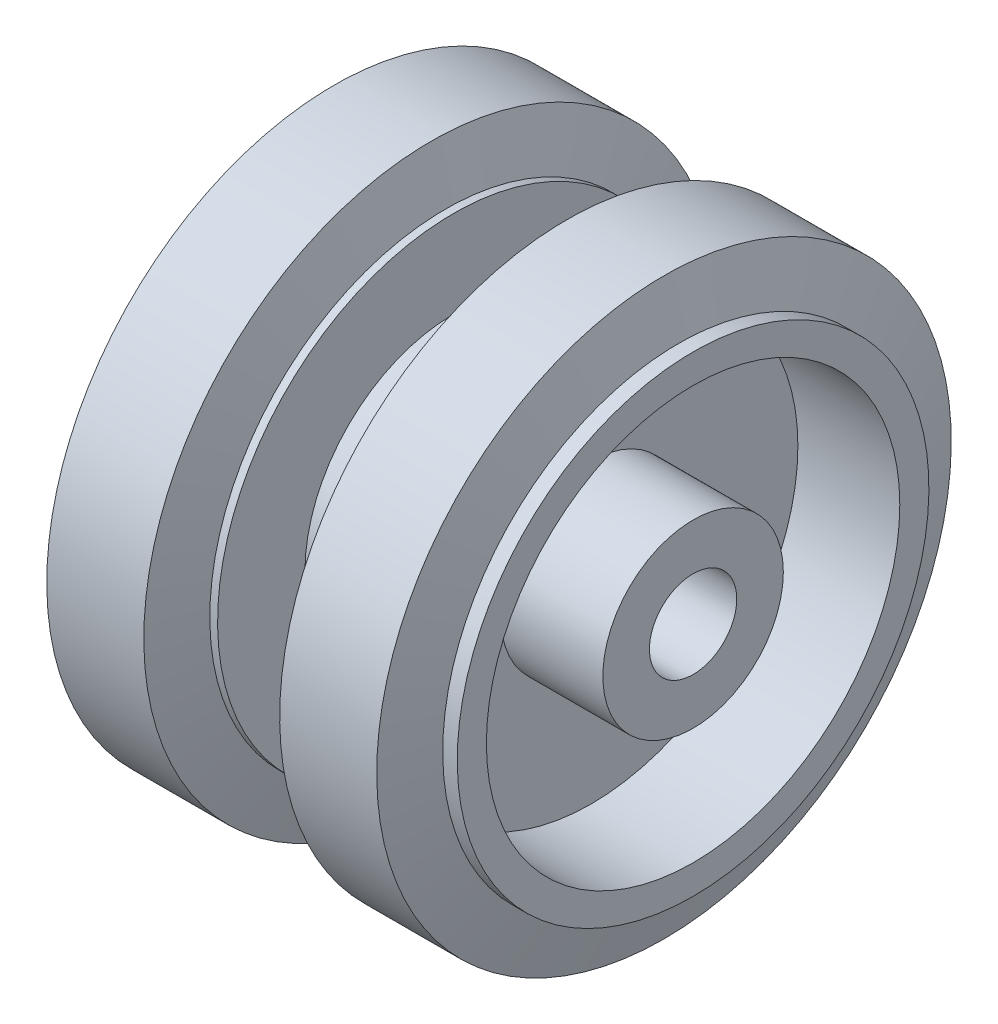
ISO-10303-21;
HEADER;
FILE_DESCRIPTION(('STEP AP214'),'2;1');
FILE_NAME('part.step','',(''),(''),'','','');
FILE_SCHEMA(('AUTOMOTIVE_DESIGN { 1 0 10303 214 1 1 1 1 }'));
ENDSEC;
DATA;
#1=APPLICATION_CONTEXT('core data for automotive mechanical design processes');
#2=APPLICATION_PROTOCOL_DEFINITION('international standard','automotive_design',2000,#1);
#3=PRODUCT_CONTEXT('',#1,'mechanical');
#4=PRODUCT('Part','Part','',(#3));
#5=PRODUCT_RELATED_PRODUCT_CATEGORY('part','',(#4));
#6=PRODUCT_DEFINITION_FORMATION('','',#4);
#7=PRODUCT_DEFINITION_CONTEXT('part definition',#1,'design');
#8=PRODUCT_DEFINITION('design','',#6,#7);
#9=PRODUCT_DEFINITION_SHAPE('','',#8);
#10=(LENGTH_UNIT() NAMED_UNIT(*) SI_UNIT(.MILLI.,.METRE.));
#11=(NAMED_UNIT(*) PLANE_ANGLE_UNIT() SI_UNIT($,.RADIAN.));
#12=(NAMED_UNIT(*) SI_UNIT($,.STERADIAN.) SOLID_ANGLE_UNIT());
#13=UNCERTAINTY_MEASURE_WITH_UNIT(LENGTH_MEASURE(1.E-05),#10,'distance_accuracy_value','');
#14=(GEOMETRIC_REPRESENTATION_CONTEXT(3) GLOBAL_UNCERTAINTY_ASSIGNED_CONTEXT((#13)) GLOBAL_UNIT_ASSIGNED_CONTEXT((#10,
#11,#12)) REPRESENTATION_CONTEXT('',''));
#15=CARTESIAN_POINT('',(0.,0.,0.));
#16=DIRECTION('',(0.,0.,1.));
#17=DIRECTION('',(1.,0.,0.));
#18=AXIS2_PLACEMENT_3D('',#15,#16,#17);
#19=CARTESIAN_POINT('',(-20.,0.,0.));
#20=DIRECTION('',(-1.,0.,0.));
#21=DIRECTION('',(0.,-1.,0.));
#22=AXIS2_PLACEMENT_3D('',#19,#20,#21);
#23=CYLINDRICAL_SURFACE('',#22,15.3);
#24=CARTESIAN_POINT('',(-4.7,0.,0.));
#25=DIRECTION('',(-1.,0.,0.));
#26=DIRECTION('',(0.,-1.,0.));
#27=AXIS2_PLACEMENT_3D('',#24,#25,#26);
#28=CIRCLE('',#27,15.3);
#29=CARTESIAN_POINT('',(-4.7,-15.3,0.));
#30=VERTEX_POINT('',#29);
#31=EDGE_CURVE('E10',#30,#30,#28,.T.);
#32=ORIENTED_EDGE('',*,*,#31,.F.);
#33=EDGE_LOOP('',(#32));
#34=FACE_BOUND('',#33,.T.);
#35=CARTESIAN_POINT('',(4.7,0.,0.));
#36=DIRECTION('',(-1.,0.,0.));
#37=DIRECTION('',(0.,-1.,0.));
#38=AXIS2_PLACEMENT_3D('',#35,#36,#37);
#39=CIRCLE('',#38,15.3);
#40=CARTESIAN_POINT('',(4.7,-15.3,0.));
#41=VERTEX_POINT('',#40);
#42=EDGE_CURVE('E100',#41,#41,#39,.T.);
#43=ORIENTED_EDGE('',*,*,#42,.T.);
#44=EDGE_LOOP('',(#43));
#45=FACE_BOUND('',#44,.T.);
#46=ADVANCED_FACE('F41',(#34,#45),#23,.T.);
#47=CARTESIAN_POINT('',(-4.7,15.3,0.));
#48=DIRECTION('',(-1.,0.,0.));
#49=DIRECTION('',(0.,-1.,0.));
#50=AXIS2_PLACEMENT_3D('',#47,#48,#49);
#51=PLANE('',#50);
#52=CARTESIAN_POINT('',(-4.7,0.,0.));
#53=DIRECTION('',(-1.,0.,0.));
#54=DIRECTION('',(0.,-1.,0.));
#55=AXIS2_PLACEMENT_3D('',#52,#53,#54);
#56=CIRCLE('',#55,24.3);
#57=CARTESIAN_POINT('',(-4.69999999999999,-24.3,0.));
#58=VERTEX_POINT('',#57);
#59=EDGE_CURVE('E48',#58,#58,#56,.T.);
#60=ORIENTED_EDGE('',*,*,#59,.F.);
#61=EDGE_LOOP('',(#60));
#62=FACE_BOUND('',#61,.T.);
#63=ORIENTED_EDGE('',*,*,#31,.T.);
#64=EDGE_LOOP('',(#63));
#65=FACE_BOUND('',#64,.T.);
#66=ADVANCED_FACE('F179',(#62,#65),#51,.F.);
#67=CARTESIAN_POINT('',(-20.,0.,0.));
#68=DIRECTION('',(-1.,0.,0.));
#69=DIRECTION('',(0.,-1.,0.));
#70=AXIS2_PLACEMENT_3D('',#67,#68,#69);
#71=CYLINDRICAL_SURFACE('',#70,24.3);
#72=CARTESIAN_POINT('',(-5.5,0.,0.));
#73=DIRECTION('',(-1.,0.,0.));
#74=DIRECTION('',(0.,-1.,0.));
#75=AXIS2_PLACEMENT_3D('',#72,#73,#74);
#76=CIRCLE('',#75,24.3);
#77=CARTESIAN_POINT('',(-5.5,-24.3,0.));
#78=VERTEX_POINT('',#77);
#79=EDGE_CURVE('E53',#78,#78,#76,.T.);
#80=ORIENTED_EDGE('',*,*,#79,.F.);
#81=EDGE_LOOP('',(#80));
#82=FACE_BOUND('',#81,.T.);
#83=ORIENTED_EDGE('',*,*,#59,.T.);
#84=EDGE_LOOP('',(#83));
#85=FACE_BOUND('',#84,.T.);
#86=ADVANCED_FACE('F184',(#82,#85),#71,.T.);
#87=CARTESIAN_POINT('',(-5.5,0.,0.));
#88=DIRECTION('',(-1.,0.,0.));
#89=DIRECTION('',(0.,-1.,0.));
#90=AXIS2_PLACEMENT_3D('',#87,#88,#89);
#91=CONICAL_SURFACE('',#90,24.3,1.29499042820637);
#92=CARTESIAN_POINT('',(-7.,0.,0.));
#93=DIRECTION('',(-1.,0.,0.));
#94=DIRECTION('',(0.,-1.,0.));
#95=AXIS2_PLACEMENT_3D('',#92,#93,#94);
#96=CIRCLE('',#95,29.6);
#97=CARTESIAN_POINT('',(-7.,-29.6,0.));
#98=VERTEX_POINT('',#97);
#99=EDGE_CURVE('E58',#98,#98,#96,.T.);
#100=ORIENTED_EDGE('',*,*,#99,.F.);
#101=EDGE_LOOP('',(#100));
#102=FACE_BOUND('',#101,.T.);
#103=ORIENTED_EDGE('',*,*,#79,.T.);
#104=EDGE_LOOP('',(#103));
#105=FACE_BOUND('',#104,.T.);
#106=ADVANCED_FACE('F238',(#102,#105),#91,.T.);
#107=CARTESIAN_POINT('',(-20.,0.,0.));
#108=DIRECTION('',(-1.,0.,0.));
#109=DIRECTION('',(0.,-1.,0.));
#110=AXIS2_PLACEMENT_3D('',#107,#108,#109);
#111=CYLINDRICAL_SURFACE('',#110,29.6);
#112=CARTESIAN_POINT('',(-17.,0.,0.));
#113=DIRECTION('',(-1.,0.,0.));
#114=DIRECTION('',(0.,-1.,0.));
#115=AXIS2_PLACEMENT_3D('',#112,#113,#114);
#116=CIRCLE('',#115,29.6);
#117=CARTESIAN_POINT('',(-17.,-29.6,0.));
#118=VERTEX_POINT('',#117);
#119=EDGE_CURVE('E64',#118,#118,#116,.T.);
#120=ORIENTED_EDGE('',*,*,#119,.F.);
#121=EDGE_LOOP('',(#120));
#122=FACE_BOUND('',#121,.T.);
#123=ORIENTED_EDGE('',*,*,#99,.T.);
#124=EDGE_LOOP('',(#123));
#125=FACE_BOUND('',#124,.T.);
#126=ADVANCED_FACE('F234',(#122,#125),#111,.T.);
#127=CARTESIAN_POINT('',(-17.,0.,0.));
#128=DIRECTION('',(1.,0.,0.));
#129=DIRECTION('',(0.,1.,0.));
#130=AXIS2_PLACEMENT_3D('',#127,#128,#129);
#131=CONICAL_SURFACE('',#130,29.6,1.29499042820638);
#132=CARTESIAN_POINT('',(-18.5,0.,0.));
#133=DIRECTION('',(-1.,0.,0.));
#134=DIRECTION('',(0.,-1.,0.));
#135=AXIS2_PLACEMENT_3D('',#132,#133,#134);
#136=CIRCLE('',#135,24.3);
#137=CARTESIAN_POINT('',(-18.5,-24.3,0.));
#138=VERTEX_POINT('',#137);
#139=EDGE_CURVE('E68',#138,#138,#136,.T.);
#140=ORIENTED_EDGE('',*,*,#139,.F.);
#141=EDGE_LOOP('',(#140));
#142=FACE_BOUND('',#141,.T.);
#143=ORIENTED_EDGE('',*,*,#119,.T.);
#144=EDGE_LOOP('',(#143));
#145=FACE_BOUND('',#144,.T.);
#146=ADVANCED_FACE('F230',(#142,#145),#131,.T.);
#147=CARTESIAN_POINT('',(-20.,0.,0.));
#148=DIRECTION('',(-1.,0.,0.));
#149=DIRECTION('',(0.,-1.,0.));
#150=AXIS2_PLACEMENT_3D('',#147,#148,#149);
#151=CYLINDRICAL_SURFACE('',#150,24.3);
#152=CARTESIAN_POINT('',(-20.,0.,0.));
#153=DIRECTION('',(-1.,0.,0.));
#154=DIRECTION('',(0.,-1.,0.));
#155=AXIS2_PLACEMENT_3D('',#152,#153,#154);
#156=CIRCLE('',#155,24.3);
#157=CARTESIAN_POINT('',(-20.,-24.3,0.));
#158=VERTEX_POINT('',#157);
#159=EDGE_CURVE('E72',#158,#158,#156,.T.);
#160=ORIENTED_EDGE('',*,*,#159,.F.);
#161=EDGE_LOOP('',(#160));
#162=FACE_BOUND('',#161,.T.);
#163=ORIENTED_EDGE('',*,*,#139,.T.);
#164=EDGE_LOOP('',(#163));
#165=FACE_BOUND('',#164,.T.);
#166=ADVANCED_FACE('F226',(#162,#165),#151,.T.);
#167=CARTESIAN_POINT('',(-20.,24.3,0.));
#168=DIRECTION('',(1.,0.,0.));
#169=DIRECTION('',(0.,1.,0.));
#170=AXIS2_PLACEMENT_3D('',#167,#168,#169);
#171=PLANE('',#170);
#172=CARTESIAN_POINT('',(-20.,0.,0.));
#173=DIRECTION('',(1.,0.,0.));
#174=DIRECTION('',(0.,0.,-1.));
#175=AXIS2_PLACEMENT_3D('',#172,#173,#174);
#176=CIRCLE('',#175,21.3);
#177=CARTESIAN_POINT('',(-20.,0.,-21.3));
#178=VERTEX_POINT('',#177);
#179=EDGE_CURVE('E88',#178,#178,#176,.T.);
#180=ORIENTED_EDGE('',*,*,#179,.T.);
#181=EDGE_LOOP('',(#180));
#182=FACE_BOUND('',#181,.T.);
#183=ORIENTED_EDGE('',*,*,#159,.T.);
#184=EDGE_LOOP('',(#183));
#185=FACE_BOUND('',#184,.T.);
#186=ADVANCED_FACE('F222',(#182,#185),#171,.F.);
#187=CARTESIAN_POINT('',(0.,0.,0.));
#188=DIRECTION('',(1.,0.,0.));
#189=DIRECTION('',(0.,0.,-1.));
#190=AXIS2_PLACEMENT_3D('',#187,#188,#189);
#191=CYLINDRICAL_SURFACE('',#190,9.3);
#192=CARTESIAN_POINT('',(-9.5,0.,0.));
#193=DIRECTION('',(1.,0.,0.));
#194=DIRECTION('',(0.,0.,-1.));
#195=AXIS2_PLACEMENT_3D('',#192,#193,#194);
#196=CIRCLE('',#195,9.3);
#197=CARTESIAN_POINT('',(-9.5,0.,-9.3));
#198=VERTEX_POINT('',#197);
#199=EDGE_CURVE('E80',#198,#198,#196,.T.);
#200=ORIENTED_EDGE('',*,*,#199,.F.);
#201=EDGE_LOOP('',(#200));
#202=FACE_BOUND('',#201,.T.);
#203=CARTESIAN_POINT('',(-20.,0.,0.));
#204=DIRECTION('',(1.,0.,0.));
#205=DIRECTION('',(0.,0.,-1.));
#206=AXIS2_PLACEMENT_3D('',#203,#204,#205);
#207=CIRCLE('',#206,9.3);
#208=CARTESIAN_POINT('',(-20.,0.,-9.3));
#209=VERTEX_POINT('',#208);
#210=EDGE_CURVE('E76',#209,#209,#207,.T.);
#211=ORIENTED_EDGE('',*,*,#210,.T.);
#212=EDGE_LOOP('',(#211));
#213=FACE_BOUND('',#212,.T.);
#214=ADVANCED_FACE('F218',(#202,#213),#191,.T.);
#215=CARTESIAN_POINT('',(-9.5,21.3,0.));
#216=DIRECTION('',(1.,0.,0.));
#217=DIRECTION('',(0.,0.,-1.));
#218=AXIS2_PLACEMENT_3D('',#215,#216,#217);
#219=PLANE('',#218);
#220=CARTESIAN_POINT('',(-9.5,0.,0.));
#221=DIRECTION('',(1.,0.,0.));
#222=DIRECTION('',(0.,0.,-1.));
#223=AXIS2_PLACEMENT_3D('',#220,#221,#222);
#224=CIRCLE('',#223,21.3);
#225=CARTESIAN_POINT('',(-9.5,0.,-21.3));
#226=VERTEX_POINT('',#225);
#227=EDGE_CURVE('E84',#226,#226,#224,.T.);
#228=ORIENTED_EDGE('',*,*,#227,.F.);
#229=EDGE_LOOP('',(#228));
#230=FACE_BOUND('',#229,.T.);
#231=ORIENTED_EDGE('',*,*,#199,.T.);
#232=EDGE_LOOP('',(#231));
#233=FACE_BOUND('',#232,.T.);
#234=ADVANCED_FACE('F214',(#230,#233),#219,.F.);
#235=CARTESIAN_POINT('',(0.,0.,0.));
#236=DIRECTION('',(1.,0.,0.));
#237=DIRECTION('',(0.,0.,-1.));
#238=AXIS2_PLACEMENT_3D('',#235,#236,#237);
#239=CYLINDRICAL_SURFACE('',#238,21.3);
#240=ORIENTED_EDGE('',*,*,#179,.F.);
#241=EDGE_LOOP('',(#240));
#242=FACE_BOUND('',#241,.T.);
#243=ORIENTED_EDGE('',*,*,#227,.T.);
#244=EDGE_LOOP('',(#243));
#245=FACE_BOUND('',#244,.T.);
#246=ADVANCED_FACE('F211',(#242,#245),#239,.F.);
#247=CARTESIAN_POINT('',(-20.,0.,0.));
#248=DIRECTION('',(1.,0.,0.));
#249=DIRECTION('',(0.,0.,-1.));
#250=AXIS2_PLACEMENT_3D('',#247,#248,#249);
#251=CIRCLE('',#250,4.5);
#252=CARTESIAN_POINT('',(-20.,0.,-4.5));
#253=VERTEX_POINT('',#252);
#254=EDGE_CURVE('E96',#253,#253,#251,.T.);
#255=ORIENTED_EDGE('',*,*,#254,.T.);
#256=EDGE_LOOP('',(#255));
#257=FACE_BOUND('',#256,.T.);
#258=ORIENTED_EDGE('',*,*,#210,.F.);
#259=EDGE_LOOP('',(#258));
#260=FACE_BOUND('',#259,.T.);
#261=ADVANCED_FACE('F209',(#257,#260),#171,.F.);
#262=CARTESIAN_POINT('',(-5.,4.5,0.));
#263=DIRECTION('',(1.,0.,0.));
#264=DIRECTION('',(0.,0.,-1.));
#265=AXIS2_PLACEMENT_3D('',#262,#263,#264);
#266=PLANE('',#265);
#267=CARTESIAN_POINT('',(-5.,0.,0.));
#268=DIRECTION('',(1.,0.,0.));
#269=DIRECTION('',(0.,0.,-1.));
#270=AXIS2_PLACEMENT_3D('',#267,#268,#269);
#271=CIRCLE('',#270,4.5);
#272=CARTESIAN_POINT('',(-5.,0.,-4.5));
#273=VERTEX_POINT('',#272);
#274=EDGE_CURVE('E92',#273,#273,#271,.T.);
#275=ORIENTED_EDGE('',*,*,#274,.F.);
#276=EDGE_LOOP('',(#275));
#277=FACE_BOUND('',#276,.T.);
#278=ADVANCED_FACE('F202',(#277),#266,.F.);
#279=CARTESIAN_POINT('',(0.,0.,0.));
#280=DIRECTION('',(1.,0.,0.));
#281=DIRECTION('',(0.,0.,-1.));
#282=AXIS2_PLACEMENT_3D('',#279,#280,#281);
#283=CYLINDRICAL_SURFACE('',#282,4.5);
#284=ORIENTED_EDGE('',*,*,#254,.F.);
#285=EDGE_LOOP('',(#284));
#286=FACE_BOUND('',#285,.T.);
#287=ORIENTED_EDGE('',*,*,#274,.T.);
#288=EDGE_LOOP('',(#287));
#289=FACE_BOUND('',#288,.T.);
#290=ADVANCED_FACE('F192',(#286,#289),#283,.F.);
#291=CARTESIAN_POINT('',(4.7,15.3,0.));
#292=DIRECTION('',(1.,0.,0.));
#293=DIRECTION('',(0.,-1.,0.));
#294=AXIS2_PLACEMENT_3D('',#291,#292,#293);
#295=PLANE('',#294);
#296=CARTESIAN_POINT('',(4.7,0.,0.));
#297=DIRECTION('',(-1.,0.,0.));
#298=DIRECTION('',(0.,-1.,0.));
#299=AXIS2_PLACEMENT_3D('',#296,#297,#298);
#300=CIRCLE('',#299,24.3);
#301=CARTESIAN_POINT('',(4.7,-24.3,0.));
#302=VERTEX_POINT('',#301);
#303=EDGE_CURVE('E104',#302,#302,#300,.T.);
#304=ORIENTED_EDGE('',*,*,#303,.T.);
#305=EDGE_LOOP('',(#304));
#306=FACE_BOUND('',#305,.T.);
#307=ORIENTED_EDGE('',*,*,#42,.F.);
#308=EDGE_LOOP('',(#307));
#309=FACE_BOUND('',#308,.T.);
#310=ADVANCED_FACE('F189',(#306,#309),#295,.F.);
#311=CARTESIAN_POINT('',(20.,0.,0.));
#312=DIRECTION('',(1.,0.,0.));
#313=DIRECTION('',(0.,-1.,0.));
#314=AXIS2_PLACEMENT_3D('',#311,#312,#313);
#315=CYLINDRICAL_SURFACE('',#314,24.3);
#316=CARTESIAN_POINT('',(5.5,0.,0.));
#317=DIRECTION('',(-1.,0.,0.));
#318=DIRECTION('',(0.,-1.,0.));
#319=AXIS2_PLACEMENT_3D('',#316,#317,#318);
#320=CIRCLE('',#319,24.3);
#321=CARTESIAN_POINT('',(5.5,-24.3,0.));
#322=VERTEX_POINT('',#321);
#323=EDGE_CURVE('E108',#322,#322,#320,.T.);
#324=ORIENTED_EDGE('',*,*,#323,.T.);
#325=EDGE_LOOP('',(#324));
#326=FACE_BOUND('',#325,.T.);
#327=ORIENTED_EDGE('',*,*,#303,.F.);
#328=EDGE_LOOP('',(#327));
#329=FACE_BOUND('',#328,.T.);
#330=ADVANCED_FACE('F191',(#326,#329),#315,.T.);
#331=CARTESIAN_POINT('',(5.5,0.,0.));
#332=DIRECTION('',(1.,0.,0.));
#333=DIRECTION('',(0.,-1.,0.));
#334=AXIS2_PLACEMENT_3D('',#331,#332,#333);
#335=CONICAL_SURFACE('',#334,24.3,1.29499042820637);
#336=CARTESIAN_POINT('',(7.,0.,0.));
#337=DIRECTION('',(-1.,0.,0.));
#338=DIRECTION('',(0.,-1.,0.));
#339=AXIS2_PLACEMENT_3D('',#336,#337,#338);
#340=CIRCLE('',#339,29.6);
#341=CARTESIAN_POINT('',(7.,-29.6,0.));
#342=VERTEX_POINT('',#341);
#343=EDGE_CURVE('E112',#342,#342,#340,.T.);
#344=ORIENTED_EDGE('',*,*,#343,.T.);
#345=EDGE_LOOP('',(#344));
#346=FACE_BOUND('',#345,.T.);
#347=ORIENTED_EDGE('',*,*,#323,.F.);
#348=EDGE_LOOP('',(#347));
#349=FACE_BOUND('',#348,.T.);
#350=ADVANCED_FACE('F199',(#346,#349),#335,.T.);
#351=CARTESIAN_POINT('',(20.,0.,0.));
#352=DIRECTION('',(1.,0.,0.));
#353=DIRECTION('',(0.,-1.,0.));
#354=AXIS2_PLACEMENT_3D('',#351,#352,#353);
#355=CYLINDRICAL_SURFACE('',#354,29.6);
#356=CARTESIAN_POINT('',(17.,0.,0.));
#357=DIRECTION('',(-1.,0.,0.));
#358=DIRECTION('',(0.,-1.,0.));
#359=AXIS2_PLACEMENT_3D('',#356,#357,#358);
#360=CIRCLE('',#359,29.6);
#361=CARTESIAN_POINT('',(17.,-29.6,0.));
#362=VERTEX_POINT('',#361);
#363=EDGE_CURVE('E116',#362,#362,#360,.T.);
#364=ORIENTED_EDGE('',*,*,#363,.T.);
#365=EDGE_LOOP('',(#364));
#366=FACE_BOUND('',#365,.T.);
#367=ORIENTED_EDGE('',*,*,#343,.F.);
#368=EDGE_LOOP('',(#367));
#369=FACE_BOUND('',#368,.T.);
#370=ADVANCED_FACE('F324',(#366,#369),#355,.T.);
#371=CARTESIAN_POINT('',(17.,0.,0.));
#372=DIRECTION('',(-1.,0.,0.));
#373=DIRECTION('',(0.,1.,0.));
#374=AXIS2_PLACEMENT_3D('',#371,#372,#373);
#375=CONICAL_SURFACE('',#374,29.6,1.29499042820638);
#376=CARTESIAN_POINT('',(18.5,0.,0.));
#377=DIRECTION('',(-1.,0.,0.));
#378=DIRECTION('',(0.,-1.,0.));
#379=AXIS2_PLACEMENT_3D('',#376,#377,#378);
#380=CIRCLE('',#379,24.3);
#381=CARTESIAN_POINT('',(18.5,-24.3,0.));
#382=VERTEX_POINT('',#381);
#383=EDGE_CURVE('E120',#382,#382,#380,.T.);
#384=ORIENTED_EDGE('',*,*,#383,.T.);
#385=EDGE_LOOP('',(#384));
#386=FACE_BOUND('',#385,.T.);
#387=ORIENTED_EDGE('',*,*,#363,.F.);
#388=EDGE_LOOP('',(#387));
#389=FACE_BOUND('',#388,.T.);
#390=ADVANCED_FACE('F334',(#386,#389),#375,.T.);
#391=CARTESIAN_POINT('',(20.,0.,0.));
#392=DIRECTION('',(1.,0.,0.));
#393=DIRECTION('',(0.,-1.,0.));
#394=AXIS2_PLACEMENT_3D('',#391,#392,#393);
#395=CYLINDRICAL_SURFACE('',#394,24.3);
#396=CARTESIAN_POINT('',(20.,0.,0.));
#397=DIRECTION('',(-1.,0.,0.));
#398=DIRECTION('',(0.,-1.,0.));
#399=AXIS2_PLACEMENT_3D('',#396,#397,#398);
#400=CIRCLE('',#399,24.3);
#401=CARTESIAN_POINT('',(20.,-24.3,0.));
#402=VERTEX_POINT('',#401);
#403=EDGE_CURVE('E124',#402,#402,#400,.T.);
#404=ORIENTED_EDGE('',*,*,#403,.T.);
#405=EDGE_LOOP('',(#404));
#406=FACE_BOUND('',#405,.T.);
#407=ORIENTED_EDGE('',*,*,#383,.F.);
#408=EDGE_LOOP('',(#407));
#409=FACE_BOUND('',#408,.T.);
#410=ADVANCED_FACE('F176',(#406,#409),#395,.T.);
#411=CARTESIAN_POINT('',(20.,24.3,0.));
#412=DIRECTION('',(-1.,0.,0.));
#413=DIRECTION('',(0.,1.,0.));
#414=AXIS2_PLACEMENT_3D('',#411,#412,#413);
#415=PLANE('',#414);
#416=CARTESIAN_POINT('',(20.,0.,0.));
#417=DIRECTION('',(1.,0.,0.));
#418=DIRECTION('',(0.,0.,-1.));
#419=AXIS2_PLACEMENT_3D('',#416,#417,#418);
#420=CIRCLE('',#419,21.3);
#421=CARTESIAN_POINT('',(20.,0.,-21.3));
#422=VERTEX_POINT('',#421);
#423=EDGE_CURVE('E140',#422,#422,#420,.T.);
#424=ORIENTED_EDGE('',*,*,#423,.F.);
#425=EDGE_LOOP('',(#424));
#426=FACE_BOUND('',#425,.T.);
#427=ORIENTED_EDGE('',*,*,#403,.F.);
#428=EDGE_LOOP('',(#427));
#429=FACE_BOUND('',#428,.T.);
#430=ADVANCED_FACE('F162',(#426,#429),#415,.F.);
#431=CARTESIAN_POINT('',(0.,0.,0.));
#432=DIRECTION('',(-1.,0.,0.));
#433=DIRECTION('',(0.,0.,-1.));
#434=AXIS2_PLACEMENT_3D('',#431,#432,#433);
#435=CYLINDRICAL_SURFACE('',#434,9.3);
#436=CARTESIAN_POINT('',(9.5,0.,0.));
#437=DIRECTION('',(1.,0.,0.));
#438=DIRECTION('',(0.,0.,-1.));
#439=AXIS2_PLACEMENT_3D('',#436,#437,#438);
#440=CIRCLE('',#439,9.3);
#441=CARTESIAN_POINT('',(9.5,0.,-9.3));
#442=VERTEX_POINT('',#441);
#443=EDGE_CURVE('E132',#442,#442,#440,.T.);
#444=ORIENTED_EDGE('',*,*,#443,.T.);
#445=EDGE_LOOP('',(#444));
#446=FACE_BOUND('',#445,.T.);
#447=CARTESIAN_POINT('',(20.,0.,0.));
#448=DIRECTION('',(1.,0.,0.));
#449=DIRECTION('',(0.,0.,-1.));
#450=AXIS2_PLACEMENT_3D('',#447,#448,#449);
#451=CIRCLE('',#450,9.3);
#452=CARTESIAN_POINT('',(20.,0.,-9.3));
#453=VERTEX_POINT('',#452);
#454=EDGE_CURVE('E128',#453,#453,#451,.T.);
#455=ORIENTED_EDGE('',*,*,#454,.F.);
#456=EDGE_LOOP('',(#455));
#457=FACE_BOUND('',#456,.T.);
#458=ADVANCED_FACE('F165',(#446,#457),#435,.T.);
#459=CARTESIAN_POINT('',(9.49999999999999,21.3,0.));
#460=DIRECTION('',(-1.,0.,0.));
#461=DIRECTION('',(0.,0.,-1.));
#462=AXIS2_PLACEMENT_3D('',#459,#460,#461);
#463=PLANE('',#462);
#464=CARTESIAN_POINT('',(9.5,0.,0.));
#465=DIRECTION('',(1.,0.,0.));
#466=DIRECTION('',(0.,0.,-1.));
#467=AXIS2_PLACEMENT_3D('',#464,#465,#466);
#468=CIRCLE('',#467,21.3);
#469=CARTESIAN_POINT('',(9.5,0.,-21.3));
#470=VERTEX_POINT('',#469);
#471=EDGE_CURVE('E136',#470,#470,#468,.T.);
#472=ORIENTED_EDGE('',*,*,#471,.T.);
#473=EDGE_LOOP('',(#472));
#474=FACE_BOUND('',#473,.T.);
#475=ORIENTED_EDGE('',*,*,#443,.F.);
#476=EDGE_LOOP('',(#475));
#477=FACE_BOUND('',#476,.T.);
#478=ADVANCED_FACE('F167',(#474,#477),#463,.F.);
#479=CARTESIAN_POINT('',(0.,0.,0.));
#480=DIRECTION('',(-1.,0.,0.));
#481=DIRECTION('',(0.,0.,-1.));
#482=AXIS2_PLACEMENT_3D('',#479,#480,#481);
#483=CYLINDRICAL_SURFACE('',#482,21.3);
#484=ORIENTED_EDGE('',*,*,#423,.T.);
#485=EDGE_LOOP('',(#484));
#486=FACE_BOUND('',#485,.T.);
#487=ORIENTED_EDGE('',*,*,#471,.F.);
#488=EDGE_LOOP('',(#487));
#489=FACE_BOUND('',#488,.T.);
#490=ADVANCED_FACE('F160',(#486,#489),#483,.F.);
#491=CARTESIAN_POINT('',(20.,0.,0.));
#492=DIRECTION('',(1.,0.,0.));
#493=DIRECTION('',(0.,0.,-1.));
#494=AXIS2_PLACEMENT_3D('',#491,#492,#493);
#495=CIRCLE('',#494,4.5);
#496=CARTESIAN_POINT('',(20.,0.,-4.5));
#497=VERTEX_POINT('',#496);
#498=EDGE_CURVE('E148',#497,#497,#495,.T.);
#499=ORIENTED_EDGE('',*,*,#498,.F.);
#500=EDGE_LOOP('',(#499));
#501=FACE_BOUND('',#500,.T.);
#502=ORIENTED_EDGE('',*,*,#454,.T.);
#503=EDGE_LOOP('',(#502));
#504=FACE_BOUND('',#503,.T.);
#505=ADVANCED_FACE('F156',(#501,#504),#415,.F.);
#506=CARTESIAN_POINT('',(5.,4.5,0.));
#507=DIRECTION('',(-1.,0.,0.));
#508=DIRECTION('',(0.,0.,-1.));
#509=AXIS2_PLACEMENT_3D('',#506,#507,#508);
#510=PLANE('',#509);
#511=CARTESIAN_POINT('',(5.,0.,0.));
#512=DIRECTION('',(1.,0.,0.));
#513=DIRECTION('',(0.,0.,-1.));
#514=AXIS2_PLACEMENT_3D('',#511,#512,#513);
#515=CIRCLE('',#514,4.5);
#516=CARTESIAN_POINT('',(5.,0.,-4.5));
#517=VERTEX_POINT('',#516);
#518=EDGE_CURVE('E144',#517,#517,#515,.T.);
#519=ORIENTED_EDGE('',*,*,#518,.T.);
#520=EDGE_LOOP('',(#519));
#521=FACE_BOUND('',#520,.T.);
#522=ADVANCED_FACE('F159',(#521),#510,.F.);
#523=CARTESIAN_POINT('',(0.,0.,0.));
#524=DIRECTION('',(-1.,0.,0.));
#525=DIRECTION('',(0.,0.,-1.));
#526=AXIS2_PLACEMENT_3D('',#523,#524,#525);
#527=CYLINDRICAL_SURFACE('',#526,4.5);
#528=ORIENTED_EDGE('',*,*,#498,.T.);
#529=EDGE_LOOP('',(#528));
#530=FACE_BOUND('',#529,.T.);
#531=ORIENTED_EDGE('',*,*,#518,.F.);
#532=EDGE_LOOP('',(#531));
#533=FACE_BOUND('',#532,.T.);
#534=ADVANCED_FACE('F153',(#530,#533),#527,.F.);
#535=CLOSED_SHELL('',(#46,#66,#86,#106,#126,#146,#166,#186,#214,#234,#246,#261,#278,#290,#310,
#330,#350,#370,#390,#410,#430,#458,#478,#490,#505,#522,#534));
#536=MANIFOLD_SOLID_BREP('B2',#535);
#537=ADVANCED_BREP_SHAPE_REPRESENTATION('',(#18,#536),#14);
#538=SHAPE_DEFINITION_REPRESENTATION(#9,#537);
ENDSEC;
END-ISO-10303-21;
